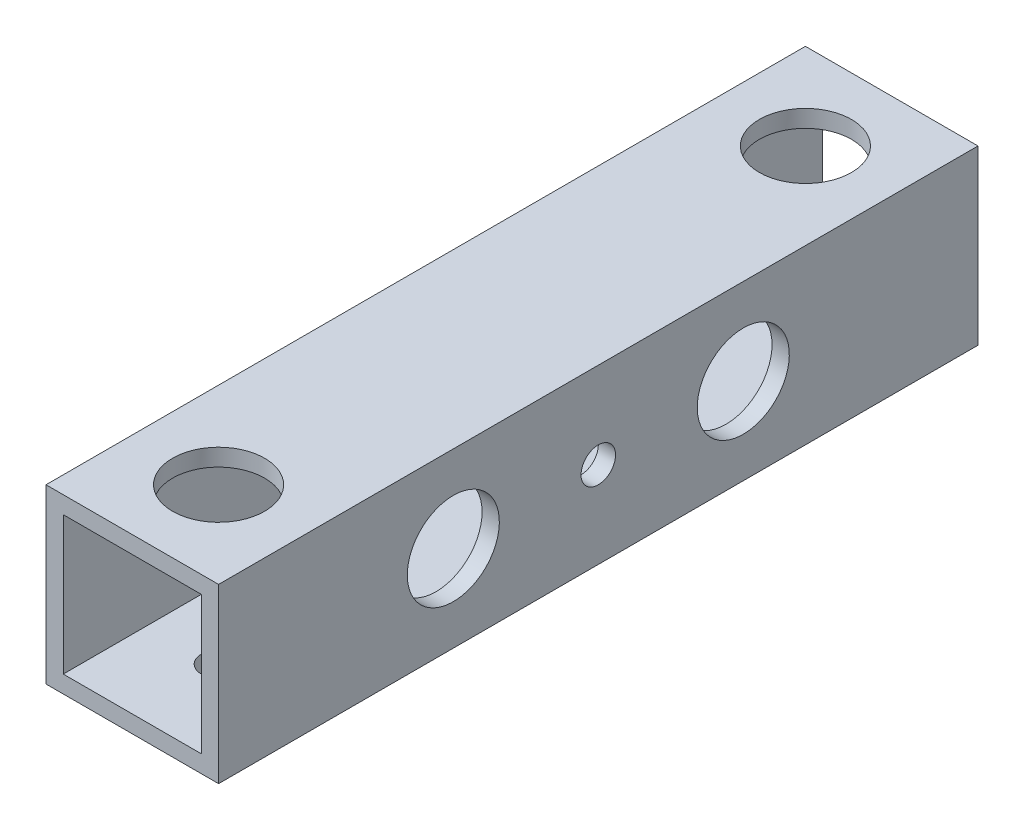
ISO-10303-21;
HEADER;
FILE_DESCRIPTION(('STEP AP214'),'2;1');
FILE_NAME('part.step','',(''),(''),'','','');
FILE_SCHEMA(('AUTOMOTIVE_DESIGN { 1 0 10303 214 1 1 1 1 }'));
ENDSEC;
DATA;
#1=APPLICATION_CONTEXT('core data for automotive mechanical design processes');
#2=APPLICATION_PROTOCOL_DEFINITION('international standard','automotive_design',2000,#1);
#3=PRODUCT_CONTEXT('',#1,'mechanical');
#4=PRODUCT('Part','Part','',(#3));
#5=PRODUCT_RELATED_PRODUCT_CATEGORY('part','',(#4));
#6=PRODUCT_DEFINITION_FORMATION('','',#4);
#7=PRODUCT_DEFINITION_CONTEXT('part definition',#1,'design');
#8=PRODUCT_DEFINITION('design','',#6,#7);
#9=PRODUCT_DEFINITION_SHAPE('','',#8);
#10=(LENGTH_UNIT() NAMED_UNIT(*) SI_UNIT(.MILLI.,.METRE.));
#11=(NAMED_UNIT(*) PLANE_ANGLE_UNIT() SI_UNIT($,.RADIAN.));
#12=(NAMED_UNIT(*) SI_UNIT($,.STERADIAN.) SOLID_ANGLE_UNIT());
#13=UNCERTAINTY_MEASURE_WITH_UNIT(LENGTH_MEASURE(1.E-05),#10,'distance_accuracy_value','');
#14=(GEOMETRIC_REPRESENTATION_CONTEXT(3) GLOBAL_UNCERTAINTY_ASSIGNED_CONTEXT((#13)) GLOBAL_UNIT_ASSIGNED_CONTEXT((#10,
#11,#12)) REPRESENTATION_CONTEXT('',''));
#15=CARTESIAN_POINT('',(0.,0.,0.));
#16=DIRECTION('',(0.,0.,1.));
#17=DIRECTION('',(1.,0.,0.));
#18=AXIS2_PLACEMENT_3D('',#15,#16,#17);
#19=CARTESIAN_POINT('',(0.,0.,66.));
#20=DIRECTION('',(0.,0.,1.));
#21=DIRECTION('',(1.,0.,0.));
#22=AXIS2_PLACEMENT_3D('',#19,#20,#21);
#23=PLANE('',#22);
#24=DIRECTION('',(0.,-1.,0.));
#25=VECTOR('',#24,1.);
#26=CARTESIAN_POINT('',(-7.01008414074451,7.73262608579252,66.));
#27=LINE('',#26,#25);
#28=CARTESIAN_POINT('',(-7.01008414074451,7.73262608579252,66.));
#29=VERTEX_POINT('',#28);
#30=CARTESIAN_POINT('',(-7.01008414074451,-7.26737391420748,66.));
#31=VERTEX_POINT('',#30);
#32=EDGE_CURVE('E138',#29,#31,#27,.T.);
#33=ORIENTED_EDGE('',*,*,#32,.T.);
#34=DIRECTION('',(1.,0.,0.));
#35=VECTOR('',#34,1.);
#36=CARTESIAN_POINT('',(-7.01008414074451,-7.26737391420748,66.));
#37=LINE('',#36,#35);
#38=CARTESIAN_POINT('',(7.98991585925548,-7.26737391420748,66.));
#39=VERTEX_POINT('',#38);
#40=EDGE_CURVE('E141',#31,#39,#37,.T.);
#41=ORIENTED_EDGE('',*,*,#40,.T.);
#42=DIRECTION('',(0.,1.,0.));
#43=VECTOR('',#42,1.);
#44=CARTESIAN_POINT('',(7.98991585925549,7.73262608579252,66.));
#45=LINE('',#44,#43);
#46=CARTESIAN_POINT('',(7.98991585925549,7.73262608579252,66.));
#47=VERTEX_POINT('',#46);
#48=EDGE_CURVE('E144',#39,#47,#45,.T.);
#49=ORIENTED_EDGE('',*,*,#48,.T.);
#50=DIRECTION('',(-1.,0.,0.));
#51=VECTOR('',#50,1.);
#52=CARTESIAN_POINT('',(-7.01008414074451,7.73262608579252,66.));
#53=LINE('',#52,#51);
#54=EDGE_CURVE('E146',#47,#29,#53,.T.);
#55=ORIENTED_EDGE('',*,*,#54,.T.);
#56=EDGE_LOOP('',(#33,#41,#49,#55));
#57=FACE_BOUND('',#56,.T.);
#58=DIRECTION('',(1.,0.,0.));
#59=VECTOR('',#58,1.);
#60=CARTESIAN_POINT('',(-5.51008414074451,-5.76737391420748,66.));
#61=LINE('',#60,#59);
#62=CARTESIAN_POINT('',(-5.51008414074451,-5.76737391420748,66.));
#63=VERTEX_POINT('',#62);
#64=CARTESIAN_POINT('',(6.48991585925549,-5.76737391420748,66.));
#65=VERTEX_POINT('',#64);
#66=EDGE_CURVE('E108',#63,#65,#61,.T.);
#67=ORIENTED_EDGE('',*,*,#66,.F.);
#68=DIRECTION('',(0.,-1.,0.));
#69=VECTOR('',#68,1.);
#70=CARTESIAN_POINT('',(-5.51008414074451,6.23262608579252,66.));
#71=LINE('',#70,#69);
#72=CARTESIAN_POINT('',(-5.51008414074451,6.23262608579252,66.));
#73=VERTEX_POINT('',#72);
#74=EDGE_CURVE('E100',#73,#63,#71,.T.);
#75=ORIENTED_EDGE('',*,*,#74,.F.);
#76=DIRECTION('',(-1.,0.,0.));
#77=VECTOR('',#76,1.);
#78=CARTESIAN_POINT('',(-5.51008414074451,6.23262608579252,66.));
#79=LINE('',#78,#77);
#80=CARTESIAN_POINT('',(6.48991585925549,6.23262608579252,66.));
#81=VERTEX_POINT('',#80);
#82=EDGE_CURVE('E122',#81,#73,#79,.T.);
#83=ORIENTED_EDGE('',*,*,#82,.F.);
#84=DIRECTION('',(0.,1.,0.));
#85=VECTOR('',#84,1.);
#86=CARTESIAN_POINT('',(6.48991585925549,6.23262608579252,66.));
#87=LINE('',#86,#85);
#88=EDGE_CURVE('E120',#65,#81,#87,.T.);
#89=ORIENTED_EDGE('',*,*,#88,.F.);
#90=EDGE_LOOP('',(#67,#75,#83,#89));
#91=FACE_BOUND('',#90,.T.);
#92=ADVANCED_FACE('F33',(#57,#91),#23,.T.);
#93=CARTESIAN_POINT('',(0.,0.,0.));
#94=DIRECTION('',(0.,0.,1.));
#95=DIRECTION('',(1.,0.,0.));
#96=AXIS2_PLACEMENT_3D('',#93,#94,#95);
#97=PLANE('',#96);
#98=DIRECTION('',(0.,-1.,0.));
#99=VECTOR('',#98,1.);
#100=CARTESIAN_POINT('',(-7.01008414074451,7.73262608579252,0.));
#101=LINE('',#100,#99);
#102=CARTESIAN_POINT('',(-7.01008414074451,7.73262608579252,0.));
#103=VERTEX_POINT('',#102);
#104=CARTESIAN_POINT('',(-7.01008414074451,-7.26737391420748,0.));
#105=VERTEX_POINT('',#104);
#106=EDGE_CURVE('E116',#103,#105,#101,.T.);
#107=ORIENTED_EDGE('',*,*,#106,.F.);
#108=DIRECTION('',(-1.,0.,0.));
#109=VECTOR('',#108,1.);
#110=CARTESIAN_POINT('',(-7.01008414074451,7.73262608579252,0.));
#111=LINE('',#110,#109);
#112=CARTESIAN_POINT('',(7.98991585925549,7.73262608579252,0.));
#113=VERTEX_POINT('',#112);
#114=EDGE_CURVE('E142',#113,#103,#111,.T.);
#115=ORIENTED_EDGE('',*,*,#114,.F.);
#116=DIRECTION('',(0.,1.,0.));
#117=VECTOR('',#116,1.);
#118=CARTESIAN_POINT('',(7.98991585925549,7.73262608579252,0.));
#119=LINE('',#118,#117);
#120=CARTESIAN_POINT('',(7.98991585925548,-7.26737391420748,0.));
#121=VERTEX_POINT('',#120);
#122=EDGE_CURVE('E153',#121,#113,#119,.T.);
#123=ORIENTED_EDGE('',*,*,#122,.F.);
#124=DIRECTION('',(1.,0.,0.));
#125=VECTOR('',#124,1.);
#126=CARTESIAN_POINT('',(-7.01008414074451,-7.26737391420748,0.));
#127=LINE('',#126,#125);
#128=EDGE_CURVE('E151',#105,#121,#127,.T.);
#129=ORIENTED_EDGE('',*,*,#128,.F.);
#130=EDGE_LOOP('',(#107,#115,#123,#129));
#131=FACE_BOUND('',#130,.T.);
#132=DIRECTION('',(0.,-1.,0.));
#133=VECTOR('',#132,1.);
#134=CARTESIAN_POINT('',(-5.51008414074451,6.23262608579252,0.));
#135=LINE('',#134,#133);
#136=CARTESIAN_POINT('',(-5.51008414074451,6.23262608579252,0.));
#137=VERTEX_POINT('',#136);
#138=CARTESIAN_POINT('',(-5.51008414074451,-5.76737391420748,0.));
#139=VERTEX_POINT('',#138);
#140=EDGE_CURVE('E58',#137,#139,#135,.T.);
#141=ORIENTED_EDGE('',*,*,#140,.T.);
#142=DIRECTION('',(1.,0.,0.));
#143=VECTOR('',#142,1.);
#144=CARTESIAN_POINT('',(-5.51008414074451,-5.76737391420748,0.));
#145=LINE('',#144,#143);
#146=CARTESIAN_POINT('',(6.48991585925549,-5.76737391420748,0.));
#147=VERTEX_POINT('',#146);
#148=EDGE_CURVE('E115',#139,#147,#145,.T.);
#149=ORIENTED_EDGE('',*,*,#148,.T.);
#150=DIRECTION('',(0.,1.,0.));
#151=VECTOR('',#150,1.);
#152=CARTESIAN_POINT('',(6.48991585925549,6.23262608579252,0.));
#153=LINE('',#152,#151);
#154=CARTESIAN_POINT('',(6.48991585925549,6.23262608579252,0.));
#155=VERTEX_POINT('',#154);
#156=EDGE_CURVE('E130',#147,#155,#153,.T.);
#157=ORIENTED_EDGE('',*,*,#156,.T.);
#158=DIRECTION('',(-1.,0.,0.));
#159=VECTOR('',#158,1.);
#160=CARTESIAN_POINT('',(-5.51008414074451,6.23262608579252,0.));
#161=LINE('',#160,#159);
#162=EDGE_CURVE('E109',#155,#137,#161,.T.);
#163=ORIENTED_EDGE('',*,*,#162,.T.);
#164=EDGE_LOOP('',(#141,#149,#157,#163));
#165=FACE_BOUND('',#164,.T.);
#166=ADVANCED_FACE('F241',(#131,#165),#97,.F.);
#167=CARTESIAN_POINT('',(-7.01008414074451,7.73262608579252,66.));
#168=DIRECTION('',(1.,0.,0.));
#169=DIRECTION('',(0.,1.,0.));
#170=AXIS2_PLACEMENT_3D('',#167,#168,#169);
#171=PLANE('',#170);
#172=CARTESIAN_POINT('',(-7.01008414074451,0.232626085792518,45.6));
#173=DIRECTION('',(-1.,0.,0.));
#174=DIRECTION('',(0.,-1.,0.));
#175=AXIS2_PLACEMENT_3D('',#172,#173,#174);
#176=CIRCLE('',#175,1.5);
#177=CARTESIAN_POINT('',(-7.01008414074451,-1.26737391420749,45.6));
#178=VERTEX_POINT('',#177);
#179=EDGE_CURVE('E189',#178,#178,#176,.T.);
#180=ORIENTED_EDGE('',*,*,#179,.F.);
#181=EDGE_LOOP('',(#180));
#182=FACE_BOUND('',#181,.T.);
#183=CARTESIAN_POINT('',(-7.01008414074451,0.232626085792518,20.4));
#184=DIRECTION('',(-1.,0.,0.));
#185=DIRECTION('',(0.,-1.,0.));
#186=AXIS2_PLACEMENT_3D('',#183,#184,#185);
#187=CIRCLE('',#186,1.5);
#188=CARTESIAN_POINT('',(-7.01008414074451,-1.26737391420748,20.4));
#189=VERTEX_POINT('',#188);
#190=EDGE_CURVE('E198',#189,#189,#187,.T.);
#191=ORIENTED_EDGE('',*,*,#190,.F.);
#192=EDGE_LOOP('',(#191));
#193=FACE_BOUND('',#192,.T.);
#194=CARTESIAN_POINT('',(-7.01008414074451,0.232626085792518,33.));
#195=DIRECTION('',(-1.,0.,0.));
#196=DIRECTION('',(0.,-1.,0.));
#197=AXIS2_PLACEMENT_3D('',#194,#195,#196);
#198=CIRCLE('',#197,4.00000000000001);
#199=CARTESIAN_POINT('',(-7.01008414074451,-3.76737391420749,33.));
#200=VERTEX_POINT('',#199);
#201=EDGE_CURVE('E173',#200,#200,#198,.T.);
#202=ORIENTED_EDGE('',*,*,#201,.F.);
#203=EDGE_LOOP('',(#202));
#204=FACE_BOUND('',#203,.T.);
#205=ORIENTED_EDGE('',*,*,#106,.T.);
#206=DIRECTION('',(0.,0.,-1.));
#207=VECTOR('',#206,1.);
#208=CARTESIAN_POINT('',(-7.01008414074451,-7.26737391420748,66.));
#209=LINE('',#208,#207);
#210=EDGE_CURVE('E11',#31,#105,#209,.T.);
#211=ORIENTED_EDGE('',*,*,#210,.F.);
#212=ORIENTED_EDGE('',*,*,#32,.F.);
#213=DIRECTION('',(0.,0.,-1.));
#214=VECTOR('',#213,1.);
#215=CARTESIAN_POINT('',(-7.01008414074451,7.73262608579252,66.));
#216=LINE('',#215,#214);
#217=EDGE_CURVE('E148',#29,#103,#216,.T.);
#218=ORIENTED_EDGE('',*,*,#217,.T.);
#219=EDGE_LOOP('',(#205,#211,#212,#218));
#220=FACE_BOUND('',#219,.T.);
#221=ADVANCED_FACE('F35',(#182,#193,#204,#220),#171,.F.);
#222=CARTESIAN_POINT('',(-7.01008414074451,-7.26737391420748,66.));
#223=DIRECTION('',(0.,1.,0.));
#224=DIRECTION('',(0.,0.,1.));
#225=AXIS2_PLACEMENT_3D('',#222,#223,#224);
#226=PLANE('',#225);
#227=CARTESIAN_POINT('',(0.489915859255487,-7.26737391420748,58.5));
#228=DIRECTION('',(0.,-1.,0.));
#229=DIRECTION('',(0.,0.,-1.));
#230=AXIS2_PLACEMENT_3D('',#227,#228,#229);
#231=CIRCLE('',#230,1.5);
#232=CARTESIAN_POINT('',(0.489915859255487,-7.26737391420748,57.));
#233=VERTEX_POINT('',#232);
#234=EDGE_CURVE('E182',#233,#233,#231,.T.);
#235=ORIENTED_EDGE('',*,*,#234,.F.);
#236=EDGE_LOOP('',(#235));
#237=FACE_BOUND('',#236,.T.);
#238=CARTESIAN_POINT('',(0.489915859255487,-7.26737391420748,7.5));
#239=DIRECTION('',(0.,-1.,0.));
#240=DIRECTION('',(0.,0.,-1.));
#241=AXIS2_PLACEMENT_3D('',#238,#239,#240);
#242=CIRCLE('',#241,1.5);
#243=CARTESIAN_POINT('',(0.489915859255487,-7.26737391420748,6.));
#244=VERTEX_POINT('',#243);
#245=EDGE_CURVE('E191',#244,#244,#242,.T.);
#246=ORIENTED_EDGE('',*,*,#245,.F.);
#247=EDGE_LOOP('',(#246));
#248=FACE_BOUND('',#247,.T.);
#249=ORIENTED_EDGE('',*,*,#128,.T.);
#250=DIRECTION('',(0.,0.,-1.));
#251=VECTOR('',#250,1.);
#252=CARTESIAN_POINT('',(7.98991585925548,-7.26737391420748,66.));
#253=LINE('',#252,#251);
#254=EDGE_CURVE('E42',#39,#121,#253,.T.);
#255=ORIENTED_EDGE('',*,*,#254,.F.);
#256=ORIENTED_EDGE('',*,*,#40,.F.);
#257=ORIENTED_EDGE('',*,*,#210,.T.);
#258=EDGE_LOOP('',(#249,#255,#256,#257));
#259=FACE_BOUND('',#258,.T.);
#260=ADVANCED_FACE('F245',(#237,#248,#259),#226,.F.);
#261=CARTESIAN_POINT('',(7.98991585925549,7.73262608579252,66.));
#262=DIRECTION('',(-1.,0.,0.));
#263=DIRECTION('',(0.,-1.,0.));
#264=AXIS2_PLACEMENT_3D('',#261,#262,#263);
#265=PLANE('',#264);
#266=CARTESIAN_POINT('',(7.98991585925548,0.232626085792515,20.4));
#267=DIRECTION('',(1.,0.,0.));
#268=DIRECTION('',(0.,1.,0.));
#269=AXIS2_PLACEMENT_3D('',#266,#267,#268);
#270=CIRCLE('',#269,4.);
#271=CARTESIAN_POINT('',(7.98991585925549,4.23262608579251,20.4));
#272=VERTEX_POINT('',#271);
#273=EDGE_CURVE('E194',#272,#272,#270,.T.);
#274=ORIENTED_EDGE('',*,*,#273,.F.);
#275=EDGE_LOOP('',(#274));
#276=FACE_BOUND('',#275,.T.);
#277=CARTESIAN_POINT('',(7.98991585925548,0.232626085792515,45.6));
#278=DIRECTION('',(1.,0.,0.));
#279=DIRECTION('',(0.,1.,0.));
#280=AXIS2_PLACEMENT_3D('',#277,#278,#279);
#281=CIRCLE('',#280,4.00000000000001);
#282=CARTESIAN_POINT('',(7.98991585925549,4.23262608579252,45.6));
#283=VERTEX_POINT('',#282);
#284=EDGE_CURVE('E200',#283,#283,#281,.T.);
#285=ORIENTED_EDGE('',*,*,#284,.F.);
#286=EDGE_LOOP('',(#285));
#287=FACE_BOUND('',#286,.T.);
#288=CARTESIAN_POINT('',(7.98991585925548,0.232626085792515,33.));
#289=DIRECTION('',(1.,0.,0.));
#290=DIRECTION('',(0.,1.,0.));
#291=AXIS2_PLACEMENT_3D('',#288,#289,#290);
#292=CIRCLE('',#291,1.5);
#293=CARTESIAN_POINT('',(7.98991585925548,1.73262608579252,33.));
#294=VERTEX_POINT('',#293);
#295=EDGE_CURVE('E177',#294,#294,#292,.T.);
#296=ORIENTED_EDGE('',*,*,#295,.F.);
#297=EDGE_LOOP('',(#296));
#298=FACE_BOUND('',#297,.T.);
#299=ORIENTED_EDGE('',*,*,#122,.T.);
#300=DIRECTION('',(0.,0.,-1.));
#301=VECTOR('',#300,1.);
#302=CARTESIAN_POINT('',(7.98991585925549,7.73262608579252,66.));
#303=LINE('',#302,#301);
#304=EDGE_CURVE('E158',#47,#113,#303,.T.);
#305=ORIENTED_EDGE('',*,*,#304,.F.);
#306=ORIENTED_EDGE('',*,*,#48,.F.);
#307=ORIENTED_EDGE('',*,*,#254,.T.);
#308=EDGE_LOOP('',(#299,#305,#306,#307));
#309=FACE_BOUND('',#308,.T.);
#310=ADVANCED_FACE('F228',(#276,#287,#298,#309),#265,.F.);
#311=CARTESIAN_POINT('',(-7.01008414074451,7.73262608579252,66.));
#312=DIRECTION('',(0.,-1.,0.));
#313=DIRECTION('',(0.,0.,-1.));
#314=AXIS2_PLACEMENT_3D('',#311,#312,#313);
#315=PLANE('',#314);
#316=CARTESIAN_POINT('',(0.489915859255487,7.73262608579252,7.5));
#317=DIRECTION('',(0.,1.,0.));
#318=DIRECTION('',(0.,0.,1.));
#319=AXIS2_PLACEMENT_3D('',#316,#317,#318);
#320=CIRCLE('',#319,4.);
#321=CARTESIAN_POINT('',(0.489915859255487,7.73262608579252,11.5));
#322=VERTEX_POINT('',#321);
#323=EDGE_CURVE('E169',#322,#322,#320,.T.);
#324=ORIENTED_EDGE('',*,*,#323,.F.);
#325=EDGE_LOOP('',(#324));
#326=FACE_BOUND('',#325,.T.);
#327=CARTESIAN_POINT('',(0.489915859255487,7.73262608579252,58.5));
#328=DIRECTION('',(0.,1.,0.));
#329=DIRECTION('',(0.,0.,1.));
#330=AXIS2_PLACEMENT_3D('',#327,#328,#329);
#331=CIRCLE('',#330,4.);
#332=CARTESIAN_POINT('',(0.489915859255487,7.73262608579252,62.5));
#333=VERTEX_POINT('',#332);
#334=EDGE_CURVE('E165',#333,#333,#331,.T.);
#335=ORIENTED_EDGE('',*,*,#334,.F.);
#336=EDGE_LOOP('',(#335));
#337=FACE_BOUND('',#336,.T.);
#338=ORIENTED_EDGE('',*,*,#114,.T.);
#339=ORIENTED_EDGE('',*,*,#217,.F.);
#340=ORIENTED_EDGE('',*,*,#54,.F.);
#341=ORIENTED_EDGE('',*,*,#304,.T.);
#342=EDGE_LOOP('',(#338,#339,#340,#341));
#343=FACE_BOUND('',#342,.T.);
#344=ADVANCED_FACE('F225',(#326,#337,#343),#315,.F.);
#345=CARTESIAN_POINT('',(-5.51008414074451,6.23262608579252,66.));
#346=DIRECTION('',(1.,0.,0.));
#347=DIRECTION('',(0.,1.,0.));
#348=AXIS2_PLACEMENT_3D('',#345,#346,#347);
#349=PLANE('',#348);
#350=CARTESIAN_POINT('',(-5.51008414074451,0.232626085792519,45.6));
#351=DIRECTION('',(1.,0.,0.));
#352=DIRECTION('',(0.,1.,0.));
#353=AXIS2_PLACEMENT_3D('',#350,#351,#352);
#354=CIRCLE('',#353,1.5);
#355=CARTESIAN_POINT('',(-5.51008414074451,1.73262608579252,45.6));
#356=VERTEX_POINT('',#355);
#357=EDGE_CURVE('E188',#356,#356,#354,.T.);
#358=ORIENTED_EDGE('',*,*,#357,.F.);
#359=EDGE_LOOP('',(#358));
#360=FACE_BOUND('',#359,.T.);
#361=CARTESIAN_POINT('',(-5.51008414074451,0.232626085792519,20.4));
#362=DIRECTION('',(1.,0.,0.));
#363=DIRECTION('',(0.,1.,0.));
#364=AXIS2_PLACEMENT_3D('',#361,#362,#363);
#365=CIRCLE('',#364,1.5);
#366=CARTESIAN_POINT('',(-5.51008414074451,1.73262608579252,20.4));
#367=VERTEX_POINT('',#366);
#368=EDGE_CURVE('E185',#367,#367,#365,.T.);
#369=ORIENTED_EDGE('',*,*,#368,.F.);
#370=EDGE_LOOP('',(#369));
#371=FACE_BOUND('',#370,.T.);
#372=CARTESIAN_POINT('',(-5.51008414074451,0.232626085792519,33.));
#373=DIRECTION('',(1.,0.,0.));
#374=DIRECTION('',(0.,1.,0.));
#375=AXIS2_PLACEMENT_3D('',#372,#373,#374);
#376=CIRCLE('',#375,4.00000000000001);
#377=CARTESIAN_POINT('',(-5.51008414074451,4.23262608579252,33.));
#378=VERTEX_POINT('',#377);
#379=EDGE_CURVE('E170',#378,#378,#376,.T.);
#380=ORIENTED_EDGE('',*,*,#379,.F.);
#381=EDGE_LOOP('',(#380));
#382=FACE_BOUND('',#381,.T.);
#383=ORIENTED_EDGE('',*,*,#140,.F.);
#384=DIRECTION('',(0.,0.,-1.));
#385=VECTOR('',#384,1.);
#386=CARTESIAN_POINT('',(-5.51008414074451,6.23262608579252,66.));
#387=LINE('',#386,#385);
#388=EDGE_CURVE('E104',#73,#137,#387,.T.);
#389=ORIENTED_EDGE('',*,*,#388,.F.);
#390=ORIENTED_EDGE('',*,*,#74,.T.);
#391=DIRECTION('',(0.,0.,-1.));
#392=VECTOR('',#391,1.);
#393=CARTESIAN_POINT('',(-5.51008414074451,-5.76737391420748,66.));
#394=LINE('',#393,#392);
#395=EDGE_CURVE('E103',#63,#139,#394,.T.);
#396=ORIENTED_EDGE('',*,*,#395,.T.);
#397=EDGE_LOOP('',(#383,#389,#390,#396));
#398=FACE_BOUND('',#397,.T.);
#399=ADVANCED_FACE('F102',(#360,#371,#382,#398),#349,.T.);
#400=CARTESIAN_POINT('',(-5.51008414074451,-5.76737391420748,66.));
#401=DIRECTION('',(0.,1.,0.));
#402=DIRECTION('',(0.,0.,1.));
#403=AXIS2_PLACEMENT_3D('',#400,#401,#402);
#404=PLANE('',#403);
#405=CARTESIAN_POINT('',(0.489915859255487,-5.76737391420748,58.5));
#406=DIRECTION('',(0.,1.,0.));
#407=DIRECTION('',(0.,0.,1.));
#408=AXIS2_PLACEMENT_3D('',#405,#406,#407);
#409=CIRCLE('',#408,1.5);
#410=CARTESIAN_POINT('',(0.489915859255487,-5.76737391420748,60.));
#411=VERTEX_POINT('',#410);
#412=EDGE_CURVE('E181',#411,#411,#409,.T.);
#413=ORIENTED_EDGE('',*,*,#412,.F.);
#414=EDGE_LOOP('',(#413));
#415=FACE_BOUND('',#414,.T.);
#416=CARTESIAN_POINT('',(0.489915859255487,-5.76737391420748,7.5));
#417=DIRECTION('',(0.,1.,0.));
#418=DIRECTION('',(0.,0.,1.));
#419=AXIS2_PLACEMENT_3D('',#416,#417,#418);
#420=CIRCLE('',#419,1.5);
#421=CARTESIAN_POINT('',(0.489915859255487,-5.76737391420748,9.));
#422=VERTEX_POINT('',#421);
#423=EDGE_CURVE('E178',#422,#422,#420,.T.);
#424=ORIENTED_EDGE('',*,*,#423,.F.);
#425=EDGE_LOOP('',(#424));
#426=FACE_BOUND('',#425,.T.);
#427=ORIENTED_EDGE('',*,*,#148,.F.);
#428=ORIENTED_EDGE('',*,*,#395,.F.);
#429=ORIENTED_EDGE('',*,*,#66,.T.);
#430=DIRECTION('',(0.,0.,-1.));
#431=VECTOR('',#430,1.);
#432=CARTESIAN_POINT('',(6.48991585925549,-5.76737391420748,66.));
#433=LINE('',#432,#431);
#434=EDGE_CURVE('E117',#65,#147,#433,.T.);
#435=ORIENTED_EDGE('',*,*,#434,.T.);
#436=EDGE_LOOP('',(#427,#428,#429,#435));
#437=FACE_BOUND('',#436,.T.);
#438=ADVANCED_FACE('F112',(#415,#426,#437),#404,.T.);
#439=CARTESIAN_POINT('',(6.48991585925549,6.23262608579252,66.));
#440=DIRECTION('',(-1.,0.,0.));
#441=DIRECTION('',(0.,-1.,0.));
#442=AXIS2_PLACEMENT_3D('',#439,#440,#441);
#443=PLANE('',#442);
#444=CARTESIAN_POINT('',(6.48991585925549,0.232626085792515,20.4));
#445=DIRECTION('',(-1.,0.,0.));
#446=DIRECTION('',(0.,-1.,0.));
#447=AXIS2_PLACEMENT_3D('',#444,#445,#446);
#448=CIRCLE('',#447,4.);
#449=CARTESIAN_POINT('',(6.48991585925549,-3.76737391420748,20.4));
#450=VERTEX_POINT('',#449);
#451=EDGE_CURVE('E37',#450,#450,#448,.T.);
#452=ORIENTED_EDGE('',*,*,#451,.F.);
#453=EDGE_LOOP('',(#452));
#454=FACE_BOUND('',#453,.T.);
#455=CARTESIAN_POINT('',(6.48991585925549,0.232626085792515,45.6));
#456=DIRECTION('',(-1.,0.,0.));
#457=DIRECTION('',(0.,-1.,0.));
#458=AXIS2_PLACEMENT_3D('',#455,#456,#457);
#459=CIRCLE('',#458,4.00000000000001);
#460=CARTESIAN_POINT('',(6.48991585925549,-3.76737391420749,45.6));
#461=VERTEX_POINT('',#460);
#462=EDGE_CURVE('E192',#461,#461,#459,.T.);
#463=ORIENTED_EDGE('',*,*,#462,.F.);
#464=EDGE_LOOP('',(#463));
#465=FACE_BOUND('',#464,.T.);
#466=CARTESIAN_POINT('',(6.48991585925549,0.232626085792515,33.));
#467=DIRECTION('',(-1.,0.,0.));
#468=DIRECTION('',(0.,-1.,0.));
#469=AXIS2_PLACEMENT_3D('',#466,#467,#468);
#470=CIRCLE('',#469,1.5);
#471=CARTESIAN_POINT('',(6.48991585925549,-1.26737391420749,33.));
#472=VERTEX_POINT('',#471);
#473=EDGE_CURVE('E174',#472,#472,#470,.T.);
#474=ORIENTED_EDGE('',*,*,#473,.F.);
#475=EDGE_LOOP('',(#474));
#476=FACE_BOUND('',#475,.T.);
#477=ORIENTED_EDGE('',*,*,#156,.F.);
#478=ORIENTED_EDGE('',*,*,#434,.F.);
#479=ORIENTED_EDGE('',*,*,#88,.T.);
#480=DIRECTION('',(0.,0.,-1.));
#481=VECTOR('',#480,1.);
#482=CARTESIAN_POINT('',(6.48991585925549,6.23262608579252,66.));
#483=LINE('',#482,#481);
#484=EDGE_CURVE('E50',#81,#155,#483,.T.);
#485=ORIENTED_EDGE('',*,*,#484,.T.);
#486=EDGE_LOOP('',(#477,#478,#479,#485));
#487=FACE_BOUND('',#486,.T.);
#488=ADVANCED_FACE('F269',(#454,#465,#476,#487),#443,.T.);
#489=CARTESIAN_POINT('',(-5.51008414074451,6.23262608579252,66.));
#490=DIRECTION('',(0.,-1.,0.));
#491=DIRECTION('',(0.,0.,-1.));
#492=AXIS2_PLACEMENT_3D('',#489,#490,#491);
#493=PLANE('',#492);
#494=CARTESIAN_POINT('',(0.489915859255487,6.23262608579252,7.5));
#495=DIRECTION('',(0.,-1.,0.));
#496=DIRECTION('',(0.,0.,-1.));
#497=AXIS2_PLACEMENT_3D('',#494,#495,#496);
#498=CIRCLE('',#497,4.);
#499=CARTESIAN_POINT('',(0.489915859255487,6.23262608579252,3.5));
#500=VERTEX_POINT('',#499);
#501=EDGE_CURVE('E166',#500,#500,#498,.T.);
#502=ORIENTED_EDGE('',*,*,#501,.F.);
#503=EDGE_LOOP('',(#502));
#504=FACE_BOUND('',#503,.T.);
#505=CARTESIAN_POINT('',(0.489915859255487,6.23262608579252,58.5));
#506=DIRECTION('',(0.,-1.,0.));
#507=DIRECTION('',(0.,0.,-1.));
#508=AXIS2_PLACEMENT_3D('',#505,#506,#507);
#509=CIRCLE('',#508,4.);
#510=CARTESIAN_POINT('',(0.489915859255487,6.23262608579252,54.5));
#511=VERTEX_POINT('',#510);
#512=EDGE_CURVE('E128',#511,#511,#509,.T.);
#513=ORIENTED_EDGE('',*,*,#512,.F.);
#514=EDGE_LOOP('',(#513));
#515=FACE_BOUND('',#514,.T.);
#516=ORIENTED_EDGE('',*,*,#162,.F.);
#517=ORIENTED_EDGE('',*,*,#484,.F.);
#518=ORIENTED_EDGE('',*,*,#82,.T.);
#519=ORIENTED_EDGE('',*,*,#388,.T.);
#520=EDGE_LOOP('',(#516,#517,#518,#519));
#521=FACE_BOUND('',#520,.T.);
#522=ADVANCED_FACE('F273',(#504,#515,#521),#493,.T.);
#523=CARTESIAN_POINT('',(0.489915859255487,-2.26737391420748,58.5));
#524=DIRECTION('',(0.,1.,0.));
#525=DIRECTION('',(0.,0.,1.));
#526=AXIS2_PLACEMENT_3D('',#523,#524,#525);
#527=CYLINDRICAL_SURFACE('',#526,4.);
#528=ORIENTED_EDGE('',*,*,#512,.T.);
#529=EDGE_LOOP('',(#528));
#530=FACE_BOUND('',#529,.T.);
#531=ORIENTED_EDGE('',*,*,#334,.T.);
#532=EDGE_LOOP('',(#531));
#533=FACE_BOUND('',#532,.T.);
#534=ADVANCED_FACE('F223',(#530,#533),#527,.F.);
#535=CARTESIAN_POINT('',(0.489915859255487,-2.26737391420748,7.5));
#536=DIRECTION('',(0.,1.,0.));
#537=DIRECTION('',(0.,0.,1.));
#538=AXIS2_PLACEMENT_3D('',#535,#536,#537);
#539=CYLINDRICAL_SURFACE('',#538,4.);
#540=ORIENTED_EDGE('',*,*,#501,.T.);
#541=EDGE_LOOP('',(#540));
#542=FACE_BOUND('',#541,.T.);
#543=ORIENTED_EDGE('',*,*,#323,.T.);
#544=EDGE_LOOP('',(#543));
#545=FACE_BOUND('',#544,.T.);
#546=ADVANCED_FACE('F280',(#542,#545),#539,.F.);
#547=CARTESIAN_POINT('',(2.98991585925549,0.23262608579252,33.));
#548=DIRECTION('',(-1.,0.,0.));
#549=DIRECTION('',(0.,-1.,0.));
#550=AXIS2_PLACEMENT_3D('',#547,#548,#549);
#551=CYLINDRICAL_SURFACE('',#550,4.00000000000001);
#552=ORIENTED_EDGE('',*,*,#379,.T.);
#553=EDGE_LOOP('',(#552));
#554=FACE_BOUND('',#553,.T.);
#555=ORIENTED_EDGE('',*,*,#201,.T.);
#556=EDGE_LOOP('',(#555));
#557=FACE_BOUND('',#556,.T.);
#558=ADVANCED_FACE('F284',(#554,#557),#551,.F.);
#559=CARTESIAN_POINT('',(-2.01008414074452,0.232626085792517,33.));
#560=DIRECTION('',(1.,0.,0.));
#561=DIRECTION('',(0.,1.,0.));
#562=AXIS2_PLACEMENT_3D('',#559,#560,#561);
#563=CYLINDRICAL_SURFACE('',#562,1.5);
#564=ORIENTED_EDGE('',*,*,#473,.T.);
#565=EDGE_LOOP('',(#564));
#566=FACE_BOUND('',#565,.T.);
#567=ORIENTED_EDGE('',*,*,#295,.T.);
#568=EDGE_LOOP('',(#567));
#569=FACE_BOUND('',#568,.T.);
#570=ADVANCED_FACE('F288',(#566,#569),#563,.F.);
#571=CARTESIAN_POINT('',(0.489915859255487,2.73262608579252,7.5));
#572=DIRECTION('',(0.,-1.,0.));
#573=DIRECTION('',(0.,0.,-1.));
#574=AXIS2_PLACEMENT_3D('',#571,#572,#573);
#575=CYLINDRICAL_SURFACE('',#574,1.5);
#576=ORIENTED_EDGE('',*,*,#423,.T.);
#577=EDGE_LOOP('',(#576));
#578=FACE_BOUND('',#577,.T.);
#579=ORIENTED_EDGE('',*,*,#245,.T.);
#580=EDGE_LOOP('',(#579));
#581=FACE_BOUND('',#580,.T.);
#582=ADVANCED_FACE('F292',(#578,#581),#575,.F.);
#583=CARTESIAN_POINT('',(0.489915859255487,2.73262608579252,58.5));
#584=DIRECTION('',(0.,-1.,0.));
#585=DIRECTION('',(0.,0.,-1.));
#586=AXIS2_PLACEMENT_3D('',#583,#584,#585);
#587=CYLINDRICAL_SURFACE('',#586,1.5);
#588=ORIENTED_EDGE('',*,*,#412,.T.);
#589=EDGE_LOOP('',(#588));
#590=FACE_BOUND('',#589,.T.);
#591=ORIENTED_EDGE('',*,*,#234,.T.);
#592=EDGE_LOOP('',(#591));
#593=FACE_BOUND('',#592,.T.);
#594=ADVANCED_FACE('F296',(#590,#593),#587,.F.);
#595=CARTESIAN_POINT('',(2.98991585925549,0.23262608579252,20.4));
#596=DIRECTION('',(-1.,0.,0.));
#597=DIRECTION('',(0.,-1.,0.));
#598=AXIS2_PLACEMENT_3D('',#595,#596,#597);
#599=CYLINDRICAL_SURFACE('',#598,1.5);
#600=ORIENTED_EDGE('',*,*,#368,.T.);
#601=EDGE_LOOP('',(#600));
#602=FACE_BOUND('',#601,.T.);
#603=ORIENTED_EDGE('',*,*,#190,.T.);
#604=EDGE_LOOP('',(#603));
#605=FACE_BOUND('',#604,.T.);
#606=ADVANCED_FACE('F300',(#602,#605),#599,.F.);
#607=CARTESIAN_POINT('',(2.98991585925549,0.23262608579252,45.6));
#608=DIRECTION('',(-1.,0.,0.));
#609=DIRECTION('',(0.,-1.,0.));
#610=AXIS2_PLACEMENT_3D('',#607,#608,#609);
#611=CYLINDRICAL_SURFACE('',#610,1.5);
#612=ORIENTED_EDGE('',*,*,#357,.T.);
#613=EDGE_LOOP('',(#612));
#614=FACE_BOUND('',#613,.T.);
#615=ORIENTED_EDGE('',*,*,#179,.T.);
#616=EDGE_LOOP('',(#615));
#617=FACE_BOUND('',#616,.T.);
#618=ADVANCED_FACE('F304',(#614,#617),#611,.F.);
#619=CARTESIAN_POINT('',(-2.01008414074452,0.232626085792517,45.6));
#620=DIRECTION('',(1.,0.,0.));
#621=DIRECTION('',(0.,1.,0.));
#622=AXIS2_PLACEMENT_3D('',#619,#620,#621);
#623=CYLINDRICAL_SURFACE('',#622,4.00000000000001);
#624=ORIENTED_EDGE('',*,*,#462,.T.);
#625=EDGE_LOOP('',(#624));
#626=FACE_BOUND('',#625,.T.);
#627=ORIENTED_EDGE('',*,*,#284,.T.);
#628=EDGE_LOOP('',(#627));
#629=FACE_BOUND('',#628,.T.);
#630=ADVANCED_FACE('F308',(#626,#629),#623,.F.);
#631=CARTESIAN_POINT('',(-2.01008414074452,0.232626085792517,20.4));
#632=DIRECTION('',(1.,0.,0.));
#633=DIRECTION('',(0.,1.,0.));
#634=AXIS2_PLACEMENT_3D('',#631,#632,#633);
#635=CYLINDRICAL_SURFACE('',#634,4.);
#636=ORIENTED_EDGE('',*,*,#451,.T.);
#637=EDGE_LOOP('',(#636));
#638=FACE_BOUND('',#637,.T.);
#639=ORIENTED_EDGE('',*,*,#273,.T.);
#640=EDGE_LOOP('',(#639));
#641=FACE_BOUND('',#640,.T.);
#642=ADVANCED_FACE('F312',(#638,#641),#635,.F.);
#643=CLOSED_SHELL('',(#92,#166,#221,#260,#310,#344,#399,#438,#488,#522,#534,#546,#558,#570,#582,
#594,#606,#618,#630,#642));
#644=MANIFOLD_SOLID_BREP('B2',#643);
#645=ADVANCED_BREP_SHAPE_REPRESENTATION('',(#18,#644),#14);
#646=SHAPE_DEFINITION_REPRESENTATION(#9,#645);
ENDSEC;
END-ISO-10303-21;
